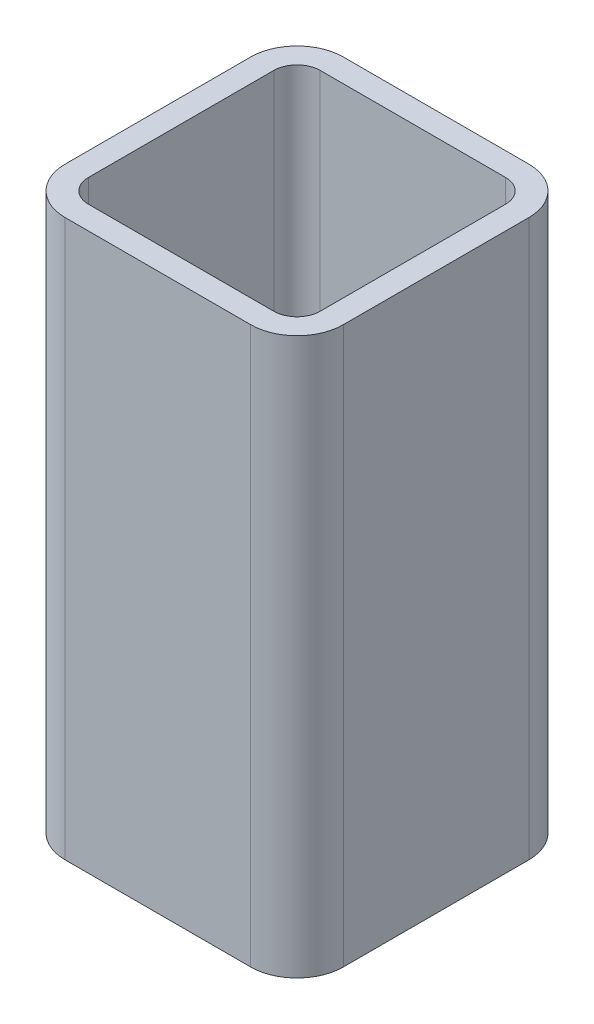
ISO-10303-21;
HEADER;
FILE_DESCRIPTION(('STEP AP214'),'2;1');
FILE_NAME('part.step','',(''),(''),'','','');
FILE_SCHEMA(('AUTOMOTIVE_DESIGN { 1 0 10303 214 1 1 1 1 }'));
ENDSEC;
DATA;
#1=APPLICATION_CONTEXT('core data for automotive mechanical design processes');
#2=APPLICATION_PROTOCOL_DEFINITION('international standard','automotive_design',2000,#1);
#3=PRODUCT_CONTEXT('',#1,'mechanical');
#4=PRODUCT('Part','Part','',(#3));
#5=PRODUCT_RELATED_PRODUCT_CATEGORY('part','',(#4));
#6=PRODUCT_DEFINITION_FORMATION('','',#4);
#7=PRODUCT_DEFINITION_CONTEXT('part definition',#1,'design');
#8=PRODUCT_DEFINITION('design','',#6,#7);
#9=PRODUCT_DEFINITION_SHAPE('','',#8);
#10=(LENGTH_UNIT() NAMED_UNIT(*) SI_UNIT(.MILLI.,.METRE.));
#11=(NAMED_UNIT(*) PLANE_ANGLE_UNIT() SI_UNIT($,.RADIAN.));
#12=(NAMED_UNIT(*) SI_UNIT($,.STERADIAN.) SOLID_ANGLE_UNIT());
#13=UNCERTAINTY_MEASURE_WITH_UNIT(LENGTH_MEASURE(1.E-05),#10,'distance_accuracy_value','');
#14=(GEOMETRIC_REPRESENTATION_CONTEXT(3) GLOBAL_UNCERTAINTY_ASSIGNED_CONTEXT((#13)) GLOBAL_UNIT_ASSIGNED_CONTEXT((#10,
#11,#12)) REPRESENTATION_CONTEXT('',''));
#15=CARTESIAN_POINT('',(0.,0.,0.));
#16=DIRECTION('',(0.,0.,1.));
#17=DIRECTION('',(1.,0.,0.));
#18=AXIS2_PLACEMENT_3D('',#15,#16,#17);
#19=CARTESIAN_POINT('',(50.8,152.4,-50.8));
#20=DIRECTION('',(0.,1.,0.));
#21=DIRECTION('',(0.,0.,1.));
#22=AXIS2_PLACEMENT_3D('',#19,#20,#21);
#23=PLANE('',#22);
#24=CARTESIAN_POINT('',(50.8,152.4,-50.8));
#25=DIRECTION('',(0.,1.,0.));
#26=DIRECTION('',(0.,0.,1.));
#27=AXIS2_PLACEMENT_3D('',#24,#25,#26);
#28=CIRCLE('',#27,25.4);
#29=CARTESIAN_POINT('',(76.2,152.4,-50.8));
#30=VERTEX_POINT('',#29);
#31=CARTESIAN_POINT('',(50.8,152.4,-76.2));
#32=VERTEX_POINT('',#31);
#33=EDGE_CURVE('E195',#30,#32,#28,.T.);
#34=ORIENTED_EDGE('',*,*,#33,.T.);
#35=DIRECTION('',(-1.,0.,0.));
#36=VECTOR('',#35,1.);
#37=CARTESIAN_POINT('',(50.8,152.4,-76.2));
#38=LINE('',#37,#36);
#39=CARTESIAN_POINT('',(-50.8,152.4,-76.2));
#40=VERTEX_POINT('',#39);
#41=EDGE_CURVE('E198',#32,#40,#38,.T.);
#42=ORIENTED_EDGE('',*,*,#41,.T.);
#43=CARTESIAN_POINT('',(-50.8,152.4,-50.8));
#44=DIRECTION('',(0.,1.,0.));
#45=DIRECTION('',(0.,0.,1.));
#46=AXIS2_PLACEMENT_3D('',#43,#44,#45);
#47=CIRCLE('',#46,25.4);
#48=CARTESIAN_POINT('',(-76.2,152.4,-50.8));
#49=VERTEX_POINT('',#48);
#50=EDGE_CURVE('E201',#40,#49,#47,.T.);
#51=ORIENTED_EDGE('',*,*,#50,.T.);
#52=DIRECTION('',(0.,0.,1.));
#53=VECTOR('',#52,1.);
#54=CARTESIAN_POINT('',(-76.2,152.4,50.8));
#55=LINE('',#54,#53);
#56=CARTESIAN_POINT('',(-76.2,152.4,50.8));
#57=VERTEX_POINT('',#56);
#58=EDGE_CURVE('E203',#49,#57,#55,.T.);
#59=ORIENTED_EDGE('',*,*,#58,.T.);
#60=CARTESIAN_POINT('',(-50.8,152.4,50.8));
#61=DIRECTION('',(0.,1.,0.));
#62=DIRECTION('',(0.,0.,1.));
#63=AXIS2_PLACEMENT_3D('',#60,#61,#62);
#64=CIRCLE('',#63,25.4);
#65=CARTESIAN_POINT('',(-50.8,152.4,76.2));
#66=VERTEX_POINT('',#65);
#67=EDGE_CURVE('E205',#57,#66,#64,.T.);
#68=ORIENTED_EDGE('',*,*,#67,.T.);
#69=DIRECTION('',(1.,0.,0.));
#70=VECTOR('',#69,1.);
#71=CARTESIAN_POINT('',(-50.8,152.4,76.2));
#72=LINE('',#71,#70);
#73=CARTESIAN_POINT('',(50.8,152.4,76.2));
#74=VERTEX_POINT('',#73);
#75=EDGE_CURVE('E207',#66,#74,#72,.T.);
#76=ORIENTED_EDGE('',*,*,#75,.T.);
#77=CARTESIAN_POINT('',(50.8,152.4,50.8));
#78=DIRECTION('',(0.,1.,0.));
#79=DIRECTION('',(0.,0.,1.));
#80=AXIS2_PLACEMENT_3D('',#77,#78,#79);
#81=CIRCLE('',#80,25.4);
#82=CARTESIAN_POINT('',(76.2,152.4,50.8));
#83=VERTEX_POINT('',#82);
#84=EDGE_CURVE('E209',#74,#83,#81,.T.);
#85=ORIENTED_EDGE('',*,*,#84,.T.);
#86=DIRECTION('',(0.,0.,-1.));
#87=VECTOR('',#86,1.);
#88=CARTESIAN_POINT('',(76.2,152.4,-50.8));
#89=LINE('',#88,#87);
#90=EDGE_CURVE('E211',#83,#30,#89,.T.);
#91=ORIENTED_EDGE('',*,*,#90,.T.);
#92=EDGE_LOOP('',(#34,#42,#51,#59,#68,#76,#85,#91));
#93=FACE_BOUND('',#92,.T.);
#94=DIRECTION('',(0.,0.,1.));
#95=VECTOR('',#94,1.);
#96=CARTESIAN_POINT('',(-63.5,152.4,50.8));
#97=LINE('',#96,#95);
#98=CARTESIAN_POINT('',(-63.5,152.4,-50.8));
#99=VERTEX_POINT('',#98);
#100=CARTESIAN_POINT('',(-63.5,152.4,50.8));
#101=VERTEX_POINT('',#100);
#102=EDGE_CURVE('E138',#99,#101,#97,.T.);
#103=ORIENTED_EDGE('',*,*,#102,.F.);
#104=CARTESIAN_POINT('',(-50.8,152.4,-50.8));
#105=DIRECTION('',(0.,1.,0.));
#106=DIRECTION('',(0.,0.,1.));
#107=AXIS2_PLACEMENT_3D('',#104,#105,#106);
#108=CIRCLE('',#107,12.7);
#109=CARTESIAN_POINT('',(-50.8,152.4,-63.5));
#110=VERTEX_POINT('',#109);
#111=EDGE_CURVE('E130',#110,#99,#108,.T.);
#112=ORIENTED_EDGE('',*,*,#111,.F.);
#113=DIRECTION('',(-1.,0.,0.));
#114=VECTOR('',#113,1.);
#115=CARTESIAN_POINT('',(50.8,152.4,-63.5));
#116=LINE('',#115,#114);
#117=CARTESIAN_POINT('',(50.8,152.4,-63.5));
#118=VERTEX_POINT('',#117);
#119=EDGE_CURVE('E163',#118,#110,#116,.T.);
#120=ORIENTED_EDGE('',*,*,#119,.F.);
#121=CARTESIAN_POINT('',(50.8,152.4,-50.8));
#122=DIRECTION('',(0.,1.,0.));
#123=DIRECTION('',(0.,0.,1.));
#124=AXIS2_PLACEMENT_3D('',#121,#122,#123);
#125=CIRCLE('',#124,12.7);
#126=CARTESIAN_POINT('',(63.5,152.4,-50.8));
#127=VERTEX_POINT('',#126);
#128=EDGE_CURVE('E161',#127,#118,#125,.T.);
#129=ORIENTED_EDGE('',*,*,#128,.F.);
#130=DIRECTION('',(0.,0.,-1.));
#131=VECTOR('',#130,1.);
#132=CARTESIAN_POINT('',(63.5,152.4,-50.8));
#133=LINE('',#132,#131);
#134=CARTESIAN_POINT('',(63.5,152.4,50.8));
#135=VERTEX_POINT('',#134);
#136=EDGE_CURVE('E159',#135,#127,#133,.T.);
#137=ORIENTED_EDGE('',*,*,#136,.F.);
#138=CARTESIAN_POINT('',(50.8,152.4,50.8));
#139=DIRECTION('',(0.,1.,0.));
#140=DIRECTION('',(0.,0.,1.));
#141=AXIS2_PLACEMENT_3D('',#138,#139,#140);
#142=CIRCLE('',#141,12.7);
#143=CARTESIAN_POINT('',(50.8,152.4,63.5));
#144=VERTEX_POINT('',#143);
#145=EDGE_CURVE('E157',#144,#135,#142,.T.);
#146=ORIENTED_EDGE('',*,*,#145,.F.);
#147=DIRECTION('',(1.,0.,0.));
#148=VECTOR('',#147,1.);
#149=CARTESIAN_POINT('',(-50.8,152.4,63.5));
#150=LINE('',#149,#148);
#151=CARTESIAN_POINT('',(-50.8,152.4,63.5));
#152=VERTEX_POINT('',#151);
#153=EDGE_CURVE('E153',#152,#144,#150,.T.);
#154=ORIENTED_EDGE('',*,*,#153,.F.);
#155=CARTESIAN_POINT('',(-50.8,152.4,50.8));
#156=DIRECTION('',(0.,1.,0.));
#157=DIRECTION('',(0.,0.,1.));
#158=AXIS2_PLACEMENT_3D('',#155,#156,#157);
#159=CIRCLE('',#158,12.7);
#160=EDGE_CURVE('E151',#101,#152,#159,.T.);
#161=ORIENTED_EDGE('',*,*,#160,.F.);
#162=EDGE_LOOP('',(#103,#112,#120,#129,#137,#146,#154,#161));
#163=FACE_BOUND('',#162,.T.);
#164=ADVANCED_FACE('F17',(#93,#163),#23,.T.);
#165=CARTESIAN_POINT('',(50.8,-152.4,-50.8));
#166=DIRECTION('',(0.,1.,0.));
#167=DIRECTION('',(0.,0.,1.));
#168=AXIS2_PLACEMENT_3D('',#165,#166,#167);
#169=PLANE('',#168);
#170=CARTESIAN_POINT('',(50.8,-152.4,-50.8));
#171=DIRECTION('',(0.,1.,0.));
#172=DIRECTION('',(0.,0.,1.));
#173=AXIS2_PLACEMENT_3D('',#170,#171,#172);
#174=CIRCLE('',#173,25.4);
#175=CARTESIAN_POINT('',(76.2,-152.4,-50.8));
#176=VERTEX_POINT('',#175);
#177=CARTESIAN_POINT('',(50.8,-152.4,-76.2));
#178=VERTEX_POINT('',#177);
#179=EDGE_CURVE('E146',#176,#178,#174,.T.);
#180=ORIENTED_EDGE('',*,*,#179,.F.);
#181=DIRECTION('',(0.,0.,-1.));
#182=VECTOR('',#181,1.);
#183=CARTESIAN_POINT('',(76.2,-152.4,-50.8));
#184=LINE('',#183,#182);
#185=CARTESIAN_POINT('',(76.2,-152.4,50.8));
#186=VERTEX_POINT('',#185);
#187=EDGE_CURVE('E199',#186,#176,#184,.T.);
#188=ORIENTED_EDGE('',*,*,#187,.F.);
#189=CARTESIAN_POINT('',(50.8,-152.4,50.8));
#190=DIRECTION('',(0.,1.,0.));
#191=DIRECTION('',(0.,0.,1.));
#192=AXIS2_PLACEMENT_3D('',#189,#190,#191);
#193=CIRCLE('',#192,25.4);
#194=CARTESIAN_POINT('',(50.8,-152.4,76.2));
#195=VERTEX_POINT('',#194);
#196=EDGE_CURVE('E226',#195,#186,#193,.T.);
#197=ORIENTED_EDGE('',*,*,#196,.F.);
#198=DIRECTION('',(1.,0.,0.));
#199=VECTOR('',#198,1.);
#200=CARTESIAN_POINT('',(-50.8,-152.4,76.2));
#201=LINE('',#200,#199);
#202=CARTESIAN_POINT('',(-50.8,-152.4,76.2));
#203=VERTEX_POINT('',#202);
#204=EDGE_CURVE('E224',#203,#195,#201,.T.);
#205=ORIENTED_EDGE('',*,*,#204,.F.);
#206=CARTESIAN_POINT('',(-50.8,-152.4,50.8));
#207=DIRECTION('',(0.,1.,0.));
#208=DIRECTION('',(0.,0.,1.));
#209=AXIS2_PLACEMENT_3D('',#206,#207,#208);
#210=CIRCLE('',#209,25.4);
#211=CARTESIAN_POINT('',(-76.2,-152.4,50.8));
#212=VERTEX_POINT('',#211);
#213=EDGE_CURVE('E222',#212,#203,#210,.T.);
#214=ORIENTED_EDGE('',*,*,#213,.F.);
#215=DIRECTION('',(0.,0.,1.));
#216=VECTOR('',#215,1.);
#217=CARTESIAN_POINT('',(-76.2,-152.4,50.8));
#218=LINE('',#217,#216);
#219=CARTESIAN_POINT('',(-76.2,-152.4,-50.8));
#220=VERTEX_POINT('',#219);
#221=EDGE_CURVE('E220',#220,#212,#218,.T.);
#222=ORIENTED_EDGE('',*,*,#221,.F.);
#223=CARTESIAN_POINT('',(-50.8,-152.4,-50.8));
#224=DIRECTION('',(0.,1.,0.));
#225=DIRECTION('',(0.,0.,1.));
#226=AXIS2_PLACEMENT_3D('',#223,#224,#225);
#227=CIRCLE('',#226,25.4);
#228=CARTESIAN_POINT('',(-50.8,-152.4,-76.2));
#229=VERTEX_POINT('',#228);
#230=EDGE_CURVE('E218',#229,#220,#227,.T.);
#231=ORIENTED_EDGE('',*,*,#230,.F.);
#232=DIRECTION('',(-1.,0.,0.));
#233=VECTOR('',#232,1.);
#234=CARTESIAN_POINT('',(50.8,-152.4,-76.2));
#235=LINE('',#234,#233);
#236=EDGE_CURVE('E216',#178,#229,#235,.T.);
#237=ORIENTED_EDGE('',*,*,#236,.F.);
#238=EDGE_LOOP('',(#180,#188,#197,#205,#214,#222,#231,#237));
#239=FACE_BOUND('',#238,.T.);
#240=CARTESIAN_POINT('',(-50.8,-152.4,-50.8));
#241=DIRECTION('',(0.,1.,0.));
#242=DIRECTION('',(0.,0.,1.));
#243=AXIS2_PLACEMENT_3D('',#240,#241,#242);
#244=CIRCLE('',#243,12.7);
#245=CARTESIAN_POINT('',(-50.8,-152.4,-63.5));
#246=VERTEX_POINT('',#245);
#247=CARTESIAN_POINT('',(-63.5,-152.4,-50.8));
#248=VERTEX_POINT('',#247);
#249=EDGE_CURVE('E40',#246,#248,#244,.T.);
#250=ORIENTED_EDGE('',*,*,#249,.T.);
#251=DIRECTION('',(0.,0.,1.));
#252=VECTOR('',#251,1.);
#253=CARTESIAN_POINT('',(-63.5,-152.4,50.8));
#254=LINE('',#253,#252);
#255=CARTESIAN_POINT('',(-63.5,-152.4,50.8));
#256=VERTEX_POINT('',#255);
#257=EDGE_CURVE('E145',#248,#256,#254,.T.);
#258=ORIENTED_EDGE('',*,*,#257,.T.);
#259=CARTESIAN_POINT('',(-50.8,-152.4,50.8));
#260=DIRECTION('',(0.,1.,0.));
#261=DIRECTION('',(0.,0.,1.));
#262=AXIS2_PLACEMENT_3D('',#259,#260,#261);
#263=CIRCLE('',#262,12.7);
#264=CARTESIAN_POINT('',(-50.8,-152.4,63.5));
#265=VERTEX_POINT('',#264);
#266=EDGE_CURVE('E167',#256,#265,#263,.T.);
#267=ORIENTED_EDGE('',*,*,#266,.T.);
#268=DIRECTION('',(1.,0.,0.));
#269=VECTOR('',#268,1.);
#270=CARTESIAN_POINT('',(-50.8,-152.4,63.5));
#271=LINE('',#270,#269);
#272=CARTESIAN_POINT('',(50.8,-152.4,63.5));
#273=VERTEX_POINT('',#272);
#274=EDGE_CURVE('E170',#265,#273,#271,.T.);
#275=ORIENTED_EDGE('',*,*,#274,.T.);
#276=CARTESIAN_POINT('',(50.8,-152.4,50.8));
#277=DIRECTION('',(0.,1.,0.));
#278=DIRECTION('',(0.,0.,1.));
#279=AXIS2_PLACEMENT_3D('',#276,#277,#278);
#280=CIRCLE('',#279,12.7);
#281=CARTESIAN_POINT('',(63.5,-152.4,50.8));
#282=VERTEX_POINT('',#281);
#283=EDGE_CURVE('E173',#273,#282,#280,.T.);
#284=ORIENTED_EDGE('',*,*,#283,.T.);
#285=DIRECTION('',(0.,0.,-1.));
#286=VECTOR('',#285,1.);
#287=CARTESIAN_POINT('',(63.5,-152.4,-50.8));
#288=LINE('',#287,#286);
#289=CARTESIAN_POINT('',(63.5,-152.4,-50.8));
#290=VERTEX_POINT('',#289);
#291=EDGE_CURVE('E176',#282,#290,#288,.T.);
#292=ORIENTED_EDGE('',*,*,#291,.T.);
#293=CARTESIAN_POINT('',(50.8,-152.4,-50.8));
#294=DIRECTION('',(0.,1.,0.));
#295=DIRECTION('',(0.,0.,1.));
#296=AXIS2_PLACEMENT_3D('',#293,#294,#295);
#297=CIRCLE('',#296,12.7);
#298=CARTESIAN_POINT('',(50.8,-152.4,-63.5));
#299=VERTEX_POINT('',#298);
#300=EDGE_CURVE('E179',#290,#299,#297,.T.);
#301=ORIENTED_EDGE('',*,*,#300,.T.);
#302=DIRECTION('',(-1.,0.,0.));
#303=VECTOR('',#302,1.);
#304=CARTESIAN_POINT('',(50.8,-152.4,-63.5));
#305=LINE('',#304,#303);
#306=EDGE_CURVE('E139',#299,#246,#305,.T.);
#307=ORIENTED_EDGE('',*,*,#306,.T.);
#308=EDGE_LOOP('',(#250,#258,#267,#275,#284,#292,#301,#307));
#309=FACE_BOUND('',#308,.T.);
#310=ADVANCED_FACE('F256',(#239,#309),#169,.F.);
#311=CARTESIAN_POINT('',(50.8,152.4,-50.8));
#312=DIRECTION('',(0.,-1.,0.));
#313=DIRECTION('',(0.,0.,-1.));
#314=AXIS2_PLACEMENT_3D('',#311,#312,#313);
#315=CYLINDRICAL_SURFACE('',#314,25.4);
#316=ORIENTED_EDGE('',*,*,#179,.T.);
#317=DIRECTION('',(0.,-1.,0.));
#318=VECTOR('',#317,1.);
#319=CARTESIAN_POINT('',(50.8,152.4,-76.2));
#320=LINE('',#319,#318);
#321=EDGE_CURVE('E11',#32,#178,#320,.T.);
#322=ORIENTED_EDGE('',*,*,#321,.F.);
#323=ORIENTED_EDGE('',*,*,#33,.F.);
#324=DIRECTION('',(0.,-1.,0.));
#325=VECTOR('',#324,1.);
#326=CARTESIAN_POINT('',(76.2,152.4,-50.8));
#327=LINE('',#326,#325);
#328=EDGE_CURVE('E213',#30,#176,#327,.T.);
#329=ORIENTED_EDGE('',*,*,#328,.T.);
#330=EDGE_LOOP('',(#316,#322,#323,#329));
#331=FACE_BOUND('',#330,.T.);
#332=ADVANCED_FACE('F19',(#331),#315,.T.);
#333=CARTESIAN_POINT('',(50.8,152.4,-76.2));
#334=DIRECTION('',(0.,0.,1.));
#335=DIRECTION('',(1.,0.,0.));
#336=AXIS2_PLACEMENT_3D('',#333,#334,#335);
#337=PLANE('',#336);
#338=ORIENTED_EDGE('',*,*,#236,.T.);
#339=DIRECTION('',(0.,-1.,0.));
#340=VECTOR('',#339,1.);
#341=CARTESIAN_POINT('',(-50.8,152.4,-76.2));
#342=LINE('',#341,#340);
#343=EDGE_CURVE('E25',#40,#229,#342,.T.);
#344=ORIENTED_EDGE('',*,*,#343,.F.);
#345=ORIENTED_EDGE('',*,*,#41,.F.);
#346=ORIENTED_EDGE('',*,*,#321,.T.);
#347=EDGE_LOOP('',(#338,#344,#345,#346));
#348=FACE_BOUND('',#347,.T.);
#349=ADVANCED_FACE('F273',(#348),#337,.F.);
#350=CARTESIAN_POINT('',(-50.8,152.4,-50.8));
#351=DIRECTION('',(0.,-1.,0.));
#352=DIRECTION('',(0.,0.,-1.));
#353=AXIS2_PLACEMENT_3D('',#350,#351,#352);
#354=CYLINDRICAL_SURFACE('',#353,25.4);
#355=ORIENTED_EDGE('',*,*,#230,.T.);
#356=DIRECTION('',(0.,-1.,0.));
#357=VECTOR('',#356,1.);
#358=CARTESIAN_POINT('',(-76.2,152.4,-50.8));
#359=LINE('',#358,#357);
#360=EDGE_CURVE('E243',#49,#220,#359,.T.);
#361=ORIENTED_EDGE('',*,*,#360,.F.);
#362=ORIENTED_EDGE('',*,*,#50,.F.);
#363=ORIENTED_EDGE('',*,*,#343,.T.);
#364=EDGE_LOOP('',(#355,#361,#362,#363));
#365=FACE_BOUND('',#364,.T.);
#366=ADVANCED_FACE('F250',(#365),#354,.T.);
#367=CARTESIAN_POINT('',(-76.2,152.4,50.8));
#368=DIRECTION('',(1.,0.,0.));
#369=DIRECTION('',(0.,0.,-1.));
#370=AXIS2_PLACEMENT_3D('',#367,#368,#369);
#371=PLANE('',#370);
#372=ORIENTED_EDGE('',*,*,#221,.T.);
#373=DIRECTION('',(0.,-1.,0.));
#374=VECTOR('',#373,1.);
#375=CARTESIAN_POINT('',(-76.2,152.4,50.8));
#376=LINE('',#375,#374);
#377=EDGE_CURVE('E240',#57,#212,#376,.T.);
#378=ORIENTED_EDGE('',*,*,#377,.F.);
#379=ORIENTED_EDGE('',*,*,#58,.F.);
#380=ORIENTED_EDGE('',*,*,#360,.T.);
#381=EDGE_LOOP('',(#372,#378,#379,#380));
#382=FACE_BOUND('',#381,.T.);
#383=ADVANCED_FACE('F262',(#382),#371,.F.);
#384=CARTESIAN_POINT('',(-50.8,152.4,50.8));
#385=DIRECTION('',(0.,-1.,0.));
#386=DIRECTION('',(0.,0.,-1.));
#387=AXIS2_PLACEMENT_3D('',#384,#385,#386);
#388=CYLINDRICAL_SURFACE('',#387,25.4);
#389=ORIENTED_EDGE('',*,*,#213,.T.);
#390=DIRECTION('',(0.,-1.,0.));
#391=VECTOR('',#390,1.);
#392=CARTESIAN_POINT('',(-50.8,152.4,76.2));
#393=LINE('',#392,#391);
#394=EDGE_CURVE('E237',#66,#203,#393,.T.);
#395=ORIENTED_EDGE('',*,*,#394,.F.);
#396=ORIENTED_EDGE('',*,*,#67,.F.);
#397=ORIENTED_EDGE('',*,*,#377,.T.);
#398=EDGE_LOOP('',(#389,#395,#396,#397));
#399=FACE_BOUND('',#398,.T.);
#400=ADVANCED_FACE('F266',(#399),#388,.T.);
#401=CARTESIAN_POINT('',(-50.8,152.4,76.2));
#402=DIRECTION('',(0.,0.,-1.));
#403=DIRECTION('',(-1.,0.,0.));
#404=AXIS2_PLACEMENT_3D('',#401,#402,#403);
#405=PLANE('',#404);
#406=ORIENTED_EDGE('',*,*,#204,.T.);
#407=DIRECTION('',(0.,-1.,0.));
#408=VECTOR('',#407,1.);
#409=CARTESIAN_POINT('',(50.8,152.4,76.2));
#410=LINE('',#409,#408);
#411=EDGE_CURVE('E234',#74,#195,#410,.T.);
#412=ORIENTED_EDGE('',*,*,#411,.F.);
#413=ORIENTED_EDGE('',*,*,#75,.F.);
#414=ORIENTED_EDGE('',*,*,#394,.T.);
#415=EDGE_LOOP('',(#406,#412,#413,#414));
#416=FACE_BOUND('',#415,.T.);
#417=ADVANCED_FACE('F286',(#416),#405,.F.);
#418=CARTESIAN_POINT('',(50.8,152.4,50.8));
#419=DIRECTION('',(0.,-1.,0.));
#420=DIRECTION('',(0.,0.,-1.));
#421=AXIS2_PLACEMENT_3D('',#418,#419,#420);
#422=CYLINDRICAL_SURFACE('',#421,25.4);
#423=ORIENTED_EDGE('',*,*,#196,.T.);
#424=DIRECTION('',(0.,-1.,0.));
#425=VECTOR('',#424,1.);
#426=CARTESIAN_POINT('',(76.2,152.4,50.8));
#427=LINE('',#426,#425);
#428=EDGE_CURVE('E231',#83,#186,#427,.T.);
#429=ORIENTED_EDGE('',*,*,#428,.F.);
#430=ORIENTED_EDGE('',*,*,#84,.F.);
#431=ORIENTED_EDGE('',*,*,#411,.T.);
#432=EDGE_LOOP('',(#423,#429,#430,#431));
#433=FACE_BOUND('',#432,.T.);
#434=ADVANCED_FACE('F284',(#433),#422,.T.);
#435=CARTESIAN_POINT('',(76.2,152.4,-50.8));
#436=DIRECTION('',(-1.,0.,0.));
#437=DIRECTION('',(0.,0.,1.));
#438=AXIS2_PLACEMENT_3D('',#435,#436,#437);
#439=PLANE('',#438);
#440=ORIENTED_EDGE('',*,*,#187,.T.);
#441=ORIENTED_EDGE('',*,*,#328,.F.);
#442=ORIENTED_EDGE('',*,*,#90,.F.);
#443=ORIENTED_EDGE('',*,*,#428,.T.);
#444=EDGE_LOOP('',(#440,#441,#442,#443));
#445=FACE_BOUND('',#444,.T.);
#446=ADVANCED_FACE('F279',(#445),#439,.F.);
#447=CARTESIAN_POINT('',(-50.8,152.4,-50.8));
#448=DIRECTION('',(0.,-1.,0.));
#449=DIRECTION('',(0.,0.,-1.));
#450=AXIS2_PLACEMENT_3D('',#447,#448,#449);
#451=CYLINDRICAL_SURFACE('',#450,12.7);
#452=ORIENTED_EDGE('',*,*,#249,.F.);
#453=DIRECTION('',(0.,-1.,0.));
#454=VECTOR('',#453,1.);
#455=CARTESIAN_POINT('',(-50.8,152.4,-63.5));
#456=LINE('',#455,#454);
#457=EDGE_CURVE('E134',#110,#246,#456,.T.);
#458=ORIENTED_EDGE('',*,*,#457,.F.);
#459=ORIENTED_EDGE('',*,*,#111,.T.);
#460=DIRECTION('',(0.,-1.,0.));
#461=VECTOR('',#460,1.);
#462=CARTESIAN_POINT('',(-63.5,152.4,-50.8));
#463=LINE('',#462,#461);
#464=EDGE_CURVE('E133',#99,#248,#463,.T.);
#465=ORIENTED_EDGE('',*,*,#464,.T.);
#466=EDGE_LOOP('',(#452,#458,#459,#465));
#467=FACE_BOUND('',#466,.T.);
#468=ADVANCED_FACE('F132',(#467),#451,.F.);
#469=CARTESIAN_POINT('',(-63.5,152.4,50.8));
#470=DIRECTION('',(1.,0.,0.));
#471=DIRECTION('',(0.,0.,-1.));
#472=AXIS2_PLACEMENT_3D('',#469,#470,#471);
#473=PLANE('',#472);
#474=ORIENTED_EDGE('',*,*,#257,.F.);
#475=ORIENTED_EDGE('',*,*,#464,.F.);
#476=ORIENTED_EDGE('',*,*,#102,.T.);
#477=DIRECTION('',(0.,-1.,0.));
#478=VECTOR('',#477,1.);
#479=CARTESIAN_POINT('',(-63.5,152.4,50.8));
#480=LINE('',#479,#478);
#481=EDGE_CURVE('E147',#101,#256,#480,.T.);
#482=ORIENTED_EDGE('',*,*,#481,.T.);
#483=EDGE_LOOP('',(#474,#475,#476,#482));
#484=FACE_BOUND('',#483,.T.);
#485=ADVANCED_FACE('F142',(#484),#473,.T.);
#486=CARTESIAN_POINT('',(-50.8,152.4,50.8));
#487=DIRECTION('',(0.,-1.,0.));
#488=DIRECTION('',(0.,0.,-1.));
#489=AXIS2_PLACEMENT_3D('',#486,#487,#488);
#490=CYLINDRICAL_SURFACE('',#489,12.7);
#491=ORIENTED_EDGE('',*,*,#266,.F.);
#492=ORIENTED_EDGE('',*,*,#481,.F.);
#493=ORIENTED_EDGE('',*,*,#160,.T.);
#494=DIRECTION('',(0.,-1.,0.));
#495=VECTOR('',#494,1.);
#496=CARTESIAN_POINT('',(-50.8,152.4,63.5));
#497=LINE('',#496,#495);
#498=EDGE_CURVE('E192',#152,#265,#497,.T.);
#499=ORIENTED_EDGE('',*,*,#498,.T.);
#500=EDGE_LOOP('',(#491,#492,#493,#499));
#501=FACE_BOUND('',#500,.T.);
#502=ADVANCED_FACE('F316',(#501),#490,.F.);
#503=CARTESIAN_POINT('',(-50.8,152.4,63.5));
#504=DIRECTION('',(0.,0.,-1.));
#505=DIRECTION('',(-1.,0.,0.));
#506=AXIS2_PLACEMENT_3D('',#503,#504,#505);
#507=PLANE('',#506);
#508=ORIENTED_EDGE('',*,*,#274,.F.);
#509=ORIENTED_EDGE('',*,*,#498,.F.);
#510=ORIENTED_EDGE('',*,*,#153,.T.);
#511=DIRECTION('',(0.,-1.,0.));
#512=VECTOR('',#511,1.);
#513=CARTESIAN_POINT('',(50.8,152.4,63.5));
#514=LINE('',#513,#512);
#515=EDGE_CURVE('E190',#144,#273,#514,.T.);
#516=ORIENTED_EDGE('',*,*,#515,.T.);
#517=EDGE_LOOP('',(#508,#509,#510,#516));
#518=FACE_BOUND('',#517,.T.);
#519=ADVANCED_FACE('F321',(#518),#507,.T.);
#520=CARTESIAN_POINT('',(50.8,152.4,50.8));
#521=DIRECTION('',(0.,-1.,0.));
#522=DIRECTION('',(0.,0.,-1.));
#523=AXIS2_PLACEMENT_3D('',#520,#521,#522);
#524=CYLINDRICAL_SURFACE('',#523,12.7);
#525=ORIENTED_EDGE('',*,*,#283,.F.);
#526=ORIENTED_EDGE('',*,*,#515,.F.);
#527=ORIENTED_EDGE('',*,*,#145,.T.);
#528=DIRECTION('',(0.,-1.,0.));
#529=VECTOR('',#528,1.);
#530=CARTESIAN_POINT('',(63.5,152.4,50.8));
#531=LINE('',#530,#529);
#532=EDGE_CURVE('E188',#135,#282,#531,.T.);
#533=ORIENTED_EDGE('',*,*,#532,.T.);
#534=EDGE_LOOP('',(#525,#526,#527,#533));
#535=FACE_BOUND('',#534,.T.);
#536=ADVANCED_FACE('F327',(#535),#524,.F.);
#537=CARTESIAN_POINT('',(63.5,152.4,-50.8));
#538=DIRECTION('',(-1.,0.,0.));
#539=DIRECTION('',(0.,0.,1.));
#540=AXIS2_PLACEMENT_3D('',#537,#538,#539);
#541=PLANE('',#540);
#542=ORIENTED_EDGE('',*,*,#291,.F.);
#543=ORIENTED_EDGE('',*,*,#532,.F.);
#544=ORIENTED_EDGE('',*,*,#136,.T.);
#545=DIRECTION('',(0.,-1.,0.));
#546=VECTOR('',#545,1.);
#547=CARTESIAN_POINT('',(63.5,152.4,-50.8));
#548=LINE('',#547,#546);
#549=EDGE_CURVE('E186',#127,#290,#548,.T.);
#550=ORIENTED_EDGE('',*,*,#549,.T.);
#551=EDGE_LOOP('',(#542,#543,#544,#550));
#552=FACE_BOUND('',#551,.T.);
#553=ADVANCED_FACE('F331',(#552),#541,.T.);
#554=CARTESIAN_POINT('',(50.8,152.4,-50.8));
#555=DIRECTION('',(0.,-1.,0.));
#556=DIRECTION('',(0.,0.,-1.));
#557=AXIS2_PLACEMENT_3D('',#554,#555,#556);
#558=CYLINDRICAL_SURFACE('',#557,12.7);
#559=ORIENTED_EDGE('',*,*,#300,.F.);
#560=ORIENTED_EDGE('',*,*,#549,.F.);
#561=ORIENTED_EDGE('',*,*,#128,.T.);
#562=DIRECTION('',(0.,-1.,0.));
#563=VECTOR('',#562,1.);
#564=CARTESIAN_POINT('',(50.8,152.4,-63.5));
#565=LINE('',#564,#563);
#566=EDGE_CURVE('E32',#118,#299,#565,.T.);
#567=ORIENTED_EDGE('',*,*,#566,.T.);
#568=EDGE_LOOP('',(#559,#560,#561,#567));
#569=FACE_BOUND('',#568,.T.);
#570=ADVANCED_FACE('F335',(#569),#558,.F.);
#571=CARTESIAN_POINT('',(50.8,152.4,-63.5));
#572=DIRECTION('',(0.,0.,1.));
#573=DIRECTION('',(1.,0.,0.));
#574=AXIS2_PLACEMENT_3D('',#571,#572,#573);
#575=PLANE('',#574);
#576=ORIENTED_EDGE('',*,*,#306,.F.);
#577=ORIENTED_EDGE('',*,*,#566,.F.);
#578=ORIENTED_EDGE('',*,*,#119,.T.);
#579=ORIENTED_EDGE('',*,*,#457,.T.);
#580=EDGE_LOOP('',(#576,#577,#578,#579));
#581=FACE_BOUND('',#580,.T.);
#582=ADVANCED_FACE('F339',(#581),#575,.T.);
#583=CLOSED_SHELL('',(#164,#310,#332,#349,#366,#383,#400,#417,#434,#446,#468,#485,#502,#519,
#536,#553,#570,#582));
#584=MANIFOLD_SOLID_BREP('B1',#583);
#585=ADVANCED_BREP_SHAPE_REPRESENTATION('',(#18,#584),#14);
#586=SHAPE_DEFINITION_REPRESENTATION(#9,#585);
ENDSEC;
END-ISO-10303-21;
